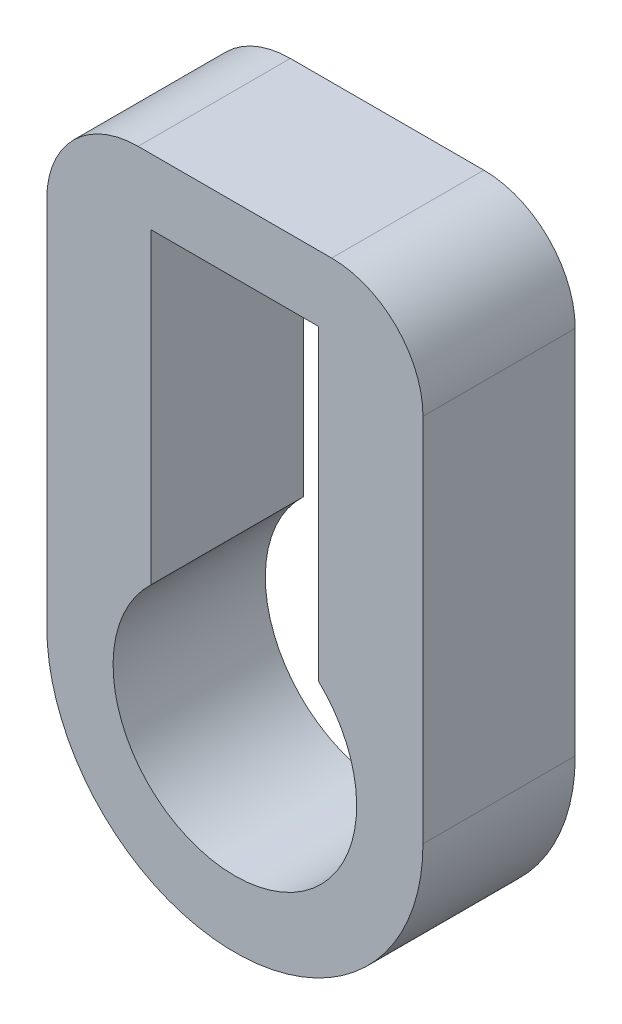
ISO-10303-21;
HEADER;
FILE_DESCRIPTION(('STEP AP214'),'2;1');
FILE_NAME('part.step','',(''),(''),'','','');
FILE_SCHEMA(('AUTOMOTIVE_DESIGN { 1 0 10303 214 1 1 1 1 }'));
ENDSEC;
DATA;
#1=APPLICATION_CONTEXT('core data for automotive mechanical design processes');
#2=APPLICATION_PROTOCOL_DEFINITION('international standard','automotive_design',2000,#1);
#3=PRODUCT_CONTEXT('',#1,'mechanical');
#4=PRODUCT('Part','Part','',(#3));
#5=PRODUCT_RELATED_PRODUCT_CATEGORY('part','',(#4));
#6=PRODUCT_DEFINITION_FORMATION('','',#4);
#7=PRODUCT_DEFINITION_CONTEXT('part definition',#1,'design');
#8=PRODUCT_DEFINITION('design','',#6,#7);
#9=PRODUCT_DEFINITION_SHAPE('','',#8);
#10=(LENGTH_UNIT() NAMED_UNIT(*) SI_UNIT(.MILLI.,.METRE.));
#11=(NAMED_UNIT(*) PLANE_ANGLE_UNIT() SI_UNIT($,.RADIAN.));
#12=(NAMED_UNIT(*) SI_UNIT($,.STERADIAN.) SOLID_ANGLE_UNIT());
#13=UNCERTAINTY_MEASURE_WITH_UNIT(LENGTH_MEASURE(1.E-05),#10,'distance_accuracy_value','');
#14=(GEOMETRIC_REPRESENTATION_CONTEXT(3) GLOBAL_UNCERTAINTY_ASSIGNED_CONTEXT((#13)) GLOBAL_UNIT_ASSIGNED_CONTEXT((#10,
#11,#12)) REPRESENTATION_CONTEXT('',''));
#15=CARTESIAN_POINT('',(0.,0.,0.));
#16=DIRECTION('',(0.,0.,1.));
#17=DIRECTION('',(1.,0.,0.));
#18=AXIS2_PLACEMENT_3D('',#15,#16,#17);
#19=CARTESIAN_POINT('',(0.6985,0.,1.27));
#20=DIRECTION('',(1.,0.,0.));
#21=DIRECTION('',(0.,1.,0.));
#22=AXIS2_PLACEMENT_3D('',#19,#20,#21);
#23=PLANE('',#22);
#24=DIRECTION('',(0.,-1.,0.));
#25=VECTOR('',#24,1.);
#26=CARTESIAN_POINT('',(0.6985,0.,0.));
#27=LINE('',#26,#25);
#28=CARTESIAN_POINT('',(0.6985,3.302,0.));
#29=VERTEX_POINT('',#28);
#30=CARTESIAN_POINT('',(0.6985,0.737803327452513,0.));
#31=VERTEX_POINT('',#30);
#32=EDGE_CURVE('E137',#29,#31,#27,.T.);
#33=ORIENTED_EDGE('',*,*,#32,.T.);
#34=DIRECTION('',(0.,0.,-1.));
#35=VECTOR('',#34,1.);
#36=CARTESIAN_POINT('',(0.6985,0.737803327452513,2.54));
#37=LINE('',#36,#35);
#38=CARTESIAN_POINT('',(0.6985,0.737803327452513,1.27));
#39=VERTEX_POINT('',#38);
#40=EDGE_CURVE('E117',#31,#39,#37,.F.);
#41=ORIENTED_EDGE('',*,*,#40,.T.);
#42=DIRECTION('',(0.,-1.,0.));
#43=VECTOR('',#42,1.);
#44=CARTESIAN_POINT('',(0.6985,0.,1.27));
#45=LINE('',#44,#43);
#46=CARTESIAN_POINT('',(0.6985,3.302,1.27));
#47=VERTEX_POINT('',#46);
#48=EDGE_CURVE('E181',#47,#39,#45,.T.);
#49=ORIENTED_EDGE('',*,*,#48,.F.);
#50=DIRECTION('',(0.,0.,-1.));
#51=VECTOR('',#50,1.);
#52=CARTESIAN_POINT('',(0.6985,3.302,1.27));
#53=LINE('',#52,#51);
#54=EDGE_CURVE('E145',#47,#29,#53,.T.);
#55=ORIENTED_EDGE('',*,*,#54,.T.);
#56=EDGE_LOOP('',(#33,#41,#49,#55));
#57=FACE_BOUND('',#56,.T.);
#58=ADVANCED_FACE('F35',(#57),#23,.F.);
#59=CARTESIAN_POINT('',(-0.6985,0.,1.27));
#60=DIRECTION('',(1.,0.,0.));
#61=DIRECTION('',(0.,1.,0.));
#62=AXIS2_PLACEMENT_3D('',#59,#60,#61);
#63=PLANE('',#62);
#64=DIRECTION('',(0.,0.,-1.));
#65=VECTOR('',#64,1.);
#66=CARTESIAN_POINT('',(-0.6985,0.737803327452513,2.54));
#67=LINE('',#66,#65);
#68=CARTESIAN_POINT('',(-0.6985,0.737803327452513,0.));
#69=VERTEX_POINT('',#68);
#70=CARTESIAN_POINT('',(-0.6985,0.737803327452513,1.27));
#71=VERTEX_POINT('',#70);
#72=EDGE_CURVE('E114',#69,#71,#67,.F.);
#73=ORIENTED_EDGE('',*,*,#72,.F.);
#74=DIRECTION('',(0.,-1.,0.));
#75=VECTOR('',#74,1.);
#76=CARTESIAN_POINT('',(-0.6985,0.,0.));
#77=LINE('',#76,#75);
#78=CARTESIAN_POINT('',(-0.6985,3.302,0.));
#79=VERTEX_POINT('',#78);
#80=EDGE_CURVE('E129',#79,#69,#77,.T.);
#81=ORIENTED_EDGE('',*,*,#80,.F.);
#82=DIRECTION('',(0.,0.,-1.));
#83=VECTOR('',#82,1.);
#84=CARTESIAN_POINT('',(-0.6985,3.302,1.27));
#85=LINE('',#84,#83);
#86=CARTESIAN_POINT('',(-0.6985,3.302,1.27));
#87=VERTEX_POINT('',#86);
#88=EDGE_CURVE('E123',#87,#79,#85,.T.);
#89=ORIENTED_EDGE('',*,*,#88,.F.);
#90=DIRECTION('',(0.,-1.,0.));
#91=VECTOR('',#90,1.);
#92=CARTESIAN_POINT('',(-0.6985,0.,1.27));
#93=LINE('',#92,#91);
#94=EDGE_CURVE('E131',#87,#71,#93,.T.);
#95=ORIENTED_EDGE('',*,*,#94,.T.);
#96=EDGE_LOOP('',(#73,#81,#89,#95));
#97=FACE_BOUND('',#96,.T.);
#98=ADVANCED_FACE('F128',(#97),#63,.T.);
#99=CARTESIAN_POINT('',(0.,0.,1.27));
#100=DIRECTION('',(0.,0.,-1.));
#101=DIRECTION('',(-1.,0.,0.));
#102=AXIS2_PLACEMENT_3D('',#99,#100,#101);
#103=CYLINDRICAL_SURFACE('',#102,1.5690165590002);
#104=CARTESIAN_POINT('',(0.,0.,0.));
#105=DIRECTION('',(0.,0.,1.));
#106=DIRECTION('',(1.,0.,0.));
#107=AXIS2_PLACEMENT_3D('',#104,#105,#106);
#108=CIRCLE('',#107,1.5690165590002);
#109=CARTESIAN_POINT('',(-1.5690165590002,0.,0.));
#110=VERTEX_POINT('',#109);
#111=CARTESIAN_POINT('',(1.5690165590002,0.,0.));
#112=VERTEX_POINT('',#111);
#113=EDGE_CURVE('E194',#110,#112,#108,.T.);
#114=ORIENTED_EDGE('',*,*,#113,.T.);
#115=DIRECTION('',(0.,0.,-1.));
#116=VECTOR('',#115,1.);
#117=CARTESIAN_POINT('',(1.5690165590002,0.,1.27));
#118=LINE('',#117,#116);
#119=CARTESIAN_POINT('',(1.5690165590002,0.,1.27));
#120=VERTEX_POINT('',#119);
#121=EDGE_CURVE('E148',#120,#112,#118,.T.);
#122=ORIENTED_EDGE('',*,*,#121,.F.);
#123=CARTESIAN_POINT('',(0.,0.,1.27));
#124=DIRECTION('',(0.,0.,1.));
#125=DIRECTION('',(1.,0.,0.));
#126=AXIS2_PLACEMENT_3D('',#123,#124,#125);
#127=CIRCLE('',#126,1.5690165590002);
#128=CARTESIAN_POINT('',(-1.5690165590002,0.,1.27));
#129=VERTEX_POINT('',#128);
#130=EDGE_CURVE('E139',#129,#120,#127,.T.);
#131=ORIENTED_EDGE('',*,*,#130,.F.);
#132=DIRECTION('',(0.,0.,-1.));
#133=VECTOR('',#132,1.);
#134=CARTESIAN_POINT('',(-1.5690165590002,0.,1.27));
#135=LINE('',#134,#133);
#136=EDGE_CURVE('E150',#129,#110,#135,.T.);
#137=ORIENTED_EDGE('',*,*,#136,.T.);
#138=EDGE_LOOP('',(#114,#122,#131,#137));
#139=FACE_BOUND('',#138,.T.);
#140=ADVANCED_FACE('F230',(#139),#103,.T.);
#141=CARTESIAN_POINT('',(1.5690165590002,0.,1.27));
#142=DIRECTION('',(-1.,0.,0.));
#143=DIRECTION('',(0.,0.,1.));
#144=AXIS2_PLACEMENT_3D('',#141,#142,#143);
#145=PLANE('',#144);
#146=DIRECTION('',(0.,1.,0.));
#147=VECTOR('',#146,1.);
#148=CARTESIAN_POINT('',(1.5690165590002,0.,0.));
#149=LINE('',#148,#147);
#150=CARTESIAN_POINT('',(1.5690165590002,3.08847946392092,0.));
#151=VERTEX_POINT('',#150);
#152=EDGE_CURVE('E192',#112,#151,#149,.T.);
#153=ORIENTED_EDGE('',*,*,#152,.T.);
#154=DIRECTION('',(0.,0.,-1.));
#155=VECTOR('',#154,1.);
#156=CARTESIAN_POINT('',(1.5690165590002,3.08847946392092,1.27));
#157=LINE('',#156,#155);
#158=CARTESIAN_POINT('',(1.5690165590002,3.08847946392092,1.27));
#159=VERTEX_POINT('',#158);
#160=EDGE_CURVE('E11',#151,#159,#157,.F.);
#161=ORIENTED_EDGE('',*,*,#160,.T.);
#162=DIRECTION('',(0.,1.,0.));
#163=VECTOR('',#162,1.);
#164=CARTESIAN_POINT('',(1.5690165590002,0.,1.27));
#165=LINE('',#164,#163);
#166=EDGE_CURVE('E204',#120,#159,#165,.T.);
#167=ORIENTED_EDGE('',*,*,#166,.F.);
#168=ORIENTED_EDGE('',*,*,#121,.T.);
#169=EDGE_LOOP('',(#153,#161,#167,#168));
#170=FACE_BOUND('',#169,.T.);
#171=ADVANCED_FACE('F234',(#170),#145,.F.);
#172=CARTESIAN_POINT('',(0.,3.85047946392092,1.27));
#173=DIRECTION('',(0.,1.,0.));
#174=DIRECTION('',(0.,0.,1.));
#175=AXIS2_PLACEMENT_3D('',#172,#173,#174);
#176=PLANE('',#175);
#177=DIRECTION('',(1.,0.,0.));
#178=VECTOR('',#177,1.);
#179=CARTESIAN_POINT('',(0.,3.85047946392092,0.));
#180=LINE('',#179,#178);
#181=CARTESIAN_POINT('',(-0.807016559000198,3.85047946392092,0.));
#182=VERTEX_POINT('',#181);
#183=CARTESIAN_POINT('',(0.807016559000198,3.85047946392092,0.));
#184=VERTEX_POINT('',#183);
#185=EDGE_CURVE('E187',#182,#184,#180,.T.);
#186=ORIENTED_EDGE('',*,*,#185,.F.);
#187=DIRECTION('',(0.,0.,-1.));
#188=VECTOR('',#187,1.);
#189=CARTESIAN_POINT('',(-0.807016559000198,3.85047946392092,1.27));
#190=LINE('',#189,#188);
#191=CARTESIAN_POINT('',(-0.807016559000198,3.85047946392092,1.27));
#192=VERTEX_POINT('',#191);
#193=EDGE_CURVE('E164',#182,#192,#190,.F.);
#194=ORIENTED_EDGE('',*,*,#193,.T.);
#195=DIRECTION('',(1.,0.,0.));
#196=VECTOR('',#195,1.);
#197=CARTESIAN_POINT('',(0.,3.85047946392092,1.27));
#198=LINE('',#197,#196);
#199=CARTESIAN_POINT('',(0.807016559000198,3.85047946392092,1.27));
#200=VERTEX_POINT('',#199);
#201=EDGE_CURVE('E172',#192,#200,#198,.T.);
#202=ORIENTED_EDGE('',*,*,#201,.T.);
#203=DIRECTION('',(0.,0.,-1.));
#204=VECTOR('',#203,1.);
#205=CARTESIAN_POINT('',(0.807016559000198,3.85047946392092,0.));
#206=LINE('',#205,#204);
#207=EDGE_CURVE('E161',#200,#184,#206,.T.);
#208=ORIENTED_EDGE('',*,*,#207,.T.);
#209=EDGE_LOOP('',(#186,#194,#202,#208));
#210=FACE_BOUND('',#209,.T.);
#211=ADVANCED_FACE('F190',(#210),#176,.T.);
#212=CARTESIAN_POINT('',(-1.5690165590002,0.,1.27));
#213=DIRECTION('',(-1.,0.,0.));
#214=DIRECTION('',(0.,0.,1.));
#215=AXIS2_PLACEMENT_3D('',#212,#213,#214);
#216=PLANE('',#215);
#217=DIRECTION('',(0.,1.,0.));
#218=VECTOR('',#217,1.);
#219=CARTESIAN_POINT('',(-1.5690165590002,0.,1.27));
#220=LINE('',#219,#218);
#221=CARTESIAN_POINT('',(-1.5690165590002,3.08847946392092,1.27));
#222=VERTEX_POINT('',#221);
#223=EDGE_CURVE('E171',#129,#222,#220,.T.);
#224=ORIENTED_EDGE('',*,*,#223,.T.);
#225=DIRECTION('',(0.,0.,-1.));
#226=VECTOR('',#225,1.);
#227=CARTESIAN_POINT('',(-1.5690165590002,3.08847946392092,1.27));
#228=LINE('',#227,#226);
#229=CARTESIAN_POINT('',(-1.5690165590002,3.08847946392092,0.));
#230=VERTEX_POINT('',#229);
#231=EDGE_CURVE('E122',#222,#230,#228,.T.);
#232=ORIENTED_EDGE('',*,*,#231,.T.);
#233=DIRECTION('',(0.,1.,0.));
#234=VECTOR('',#233,1.);
#235=CARTESIAN_POINT('',(-1.5690165590002,0.,0.));
#236=LINE('',#235,#234);
#237=EDGE_CURVE('E141',#110,#230,#236,.T.);
#238=ORIENTED_EDGE('',*,*,#237,.F.);
#239=ORIENTED_EDGE('',*,*,#136,.F.);
#240=EDGE_LOOP('',(#224,#232,#238,#239));
#241=FACE_BOUND('',#240,.T.);
#242=ADVANCED_FACE('F177',(#241),#216,.T.);
#243=CARTESIAN_POINT('',(0.,3.302,1.27));
#244=DIRECTION('',(0.,1.,0.));
#245=DIRECTION('',(0.,0.,1.));
#246=AXIS2_PLACEMENT_3D('',#243,#244,#245);
#247=PLANE('',#246);
#248=DIRECTION('',(1.,0.,0.));
#249=VECTOR('',#248,1.);
#250=CARTESIAN_POINT('',(0.,3.302,0.));
#251=LINE('',#250,#249);
#252=EDGE_CURVE('E136',#79,#29,#251,.T.);
#253=ORIENTED_EDGE('',*,*,#252,.T.);
#254=ORIENTED_EDGE('',*,*,#54,.F.);
#255=DIRECTION('',(1.,0.,0.));
#256=VECTOR('',#255,1.);
#257=CARTESIAN_POINT('',(0.,3.302,1.27));
#258=LINE('',#257,#256);
#259=EDGE_CURVE('E152',#87,#47,#258,.T.);
#260=ORIENTED_EDGE('',*,*,#259,.F.);
#261=ORIENTED_EDGE('',*,*,#88,.T.);
#262=EDGE_LOOP('',(#253,#254,#260,#261));
#263=FACE_BOUND('',#262,.T.);
#264=ADVANCED_FACE('F214',(#263),#247,.F.);
#265=CARTESIAN_POINT('',(0.,0.,1.27));
#266=DIRECTION('',(0.,0.,1.));
#267=DIRECTION('',(1.,0.,0.));
#268=AXIS2_PLACEMENT_3D('',#265,#266,#267);
#269=PLANE('',#268);
#270=CARTESIAN_POINT('',(0.,0.,1.27));
#271=DIRECTION('',(0.,0.,1.));
#272=DIRECTION('',(1.,0.,0.));
#273=AXIS2_PLACEMENT_3D('',#270,#271,#272);
#274=CIRCLE('',#273,1.016);
#275=EDGE_CURVE('E132',#71,#39,#274,.T.);
#276=ORIENTED_EDGE('',*,*,#275,.F.);
#277=ORIENTED_EDGE('',*,*,#94,.F.);
#278=ORIENTED_EDGE('',*,*,#259,.T.);
#279=ORIENTED_EDGE('',*,*,#48,.T.);
#280=EDGE_LOOP('',(#276,#277,#278,#279));
#281=FACE_BOUND('',#280,.T.);
#282=ORIENTED_EDGE('',*,*,#201,.F.);
#283=CARTESIAN_POINT('',(-0.807016559000198,3.08847946392092,1.27));
#284=DIRECTION('',(0.,0.,1.));
#285=DIRECTION('',(1.,0.,0.));
#286=AXIS2_PLACEMENT_3D('',#283,#284,#285);
#287=CIRCLE('',#286,0.762);
#288=EDGE_CURVE('E43',#192,#222,#287,.T.);
#289=ORIENTED_EDGE('',*,*,#288,.T.);
#290=ORIENTED_EDGE('',*,*,#223,.F.);
#291=ORIENTED_EDGE('',*,*,#130,.T.);
#292=ORIENTED_EDGE('',*,*,#166,.T.);
#293=CARTESIAN_POINT('',(0.807016559000198,3.08847946392092,1.27));
#294=DIRECTION('',(0.,0.,1.));
#295=DIRECTION('',(1.,0.,0.));
#296=AXIS2_PLACEMENT_3D('',#293,#294,#295);
#297=CIRCLE('',#296,0.762);
#298=EDGE_CURVE('E55',#159,#200,#297,.T.);
#299=ORIENTED_EDGE('',*,*,#298,.T.);
#300=EDGE_LOOP('',(#282,#289,#290,#291,#292,#299));
#301=FACE_BOUND('',#300,.T.);
#302=ADVANCED_FACE('F169',(#281,#301),#269,.T.);
#303=CARTESIAN_POINT('',(0.,0.,0.));
#304=DIRECTION('',(0.,0.,1.));
#305=DIRECTION('',(1.,0.,0.));
#306=AXIS2_PLACEMENT_3D('',#303,#304,#305);
#307=PLANE('',#306);
#308=ORIENTED_EDGE('',*,*,#237,.T.);
#309=CARTESIAN_POINT('',(-0.807016559000198,3.08847946392092,0.));
#310=DIRECTION('',(0.,0.,1.));
#311=DIRECTION('',(1.,0.,0.));
#312=AXIS2_PLACEMENT_3D('',#309,#310,#311);
#313=CIRCLE('',#312,0.762);
#314=EDGE_CURVE('E159',#230,#182,#313,.F.);
#315=ORIENTED_EDGE('',*,*,#314,.T.);
#316=ORIENTED_EDGE('',*,*,#185,.T.);
#317=CARTESIAN_POINT('',(0.807016559000198,3.08847946392092,0.));
#318=DIRECTION('',(0.,0.,1.));
#319=DIRECTION('',(1.,0.,0.));
#320=AXIS2_PLACEMENT_3D('',#317,#318,#319);
#321=CIRCLE('',#320,0.762);
#322=EDGE_CURVE('E157',#184,#151,#321,.F.);
#323=ORIENTED_EDGE('',*,*,#322,.T.);
#324=ORIENTED_EDGE('',*,*,#152,.F.);
#325=ORIENTED_EDGE('',*,*,#113,.F.);
#326=EDGE_LOOP('',(#308,#315,#316,#323,#324,#325));
#327=FACE_BOUND('',#326,.T.);
#328=ORIENTED_EDGE('',*,*,#80,.T.);
#329=CARTESIAN_POINT('',(0.,0.,0.));
#330=DIRECTION('',(0.,0.,1.));
#331=DIRECTION('',(1.,0.,0.));
#332=AXIS2_PLACEMENT_3D('',#329,#330,#331);
#333=CIRCLE('',#332,1.016);
#334=EDGE_CURVE('E111',#69,#31,#333,.T.);
#335=ORIENTED_EDGE('',*,*,#334,.T.);
#336=ORIENTED_EDGE('',*,*,#32,.F.);
#337=ORIENTED_EDGE('',*,*,#252,.F.);
#338=EDGE_LOOP('',(#328,#335,#336,#337));
#339=FACE_BOUND('',#338,.T.);
#340=ADVANCED_FACE('F135',(#327,#339),#307,.F.);
#341=CARTESIAN_POINT('',(0.,0.,2.54));
#342=DIRECTION('',(0.,0.,-1.));
#343=DIRECTION('',(-1.,0.,0.));
#344=AXIS2_PLACEMENT_3D('',#341,#342,#343);
#345=CYLINDRICAL_SURFACE('',#344,1.016);
#346=ORIENTED_EDGE('',*,*,#334,.F.);
#347=ORIENTED_EDGE('',*,*,#72,.T.);
#348=ORIENTED_EDGE('',*,*,#275,.T.);
#349=ORIENTED_EDGE('',*,*,#40,.F.);
#350=EDGE_LOOP('',(#346,#347,#348,#349));
#351=FACE_BOUND('',#350,.T.);
#352=ADVANCED_FACE('F113',(#351),#345,.F.);
#353=CARTESIAN_POINT('',(-0.807016559000198,3.08847946392092,1.27));
#354=DIRECTION('',(0.,0.,-1.));
#355=DIRECTION('',(-1.,0.,0.));
#356=AXIS2_PLACEMENT_3D('',#353,#354,#355);
#357=CYLINDRICAL_SURFACE('',#356,0.762);
#358=ORIENTED_EDGE('',*,*,#288,.F.);
#359=ORIENTED_EDGE('',*,*,#193,.F.);
#360=ORIENTED_EDGE('',*,*,#314,.F.);
#361=ORIENTED_EDGE('',*,*,#231,.F.);
#362=EDGE_LOOP('',(#358,#359,#360,#361));
#363=FACE_BOUND('',#362,.T.);
#364=ADVANCED_FACE('F183',(#363),#357,.T.);
#365=CARTESIAN_POINT('',(0.807016559000198,3.08847946392092,1.27));
#366=DIRECTION('',(0.,0.,1.));
#367=DIRECTION('',(1.,0.,0.));
#368=AXIS2_PLACEMENT_3D('',#365,#366,#367);
#369=CYLINDRICAL_SURFACE('',#368,0.762);
#370=ORIENTED_EDGE('',*,*,#298,.F.);
#371=ORIENTED_EDGE('',*,*,#160,.F.);
#372=ORIENTED_EDGE('',*,*,#322,.F.);
#373=ORIENTED_EDGE('',*,*,#207,.F.);
#374=EDGE_LOOP('',(#370,#371,#372,#373));
#375=FACE_BOUND('',#374,.T.);
#376=ADVANCED_FACE('F37',(#375),#369,.T.);
#377=CLOSED_SHELL('',(#58,#98,#140,#171,#211,#242,#264,#302,#340,#352,#364,#376));
#378=MANIFOLD_SOLID_BREP('B2',#377);
#379=ADVANCED_BREP_SHAPE_REPRESENTATION('',(#18,#378),#14);
#380=SHAPE_DEFINITION_REPRESENTATION(#9,#379);
ENDSEC;
END-ISO-10303-21;
